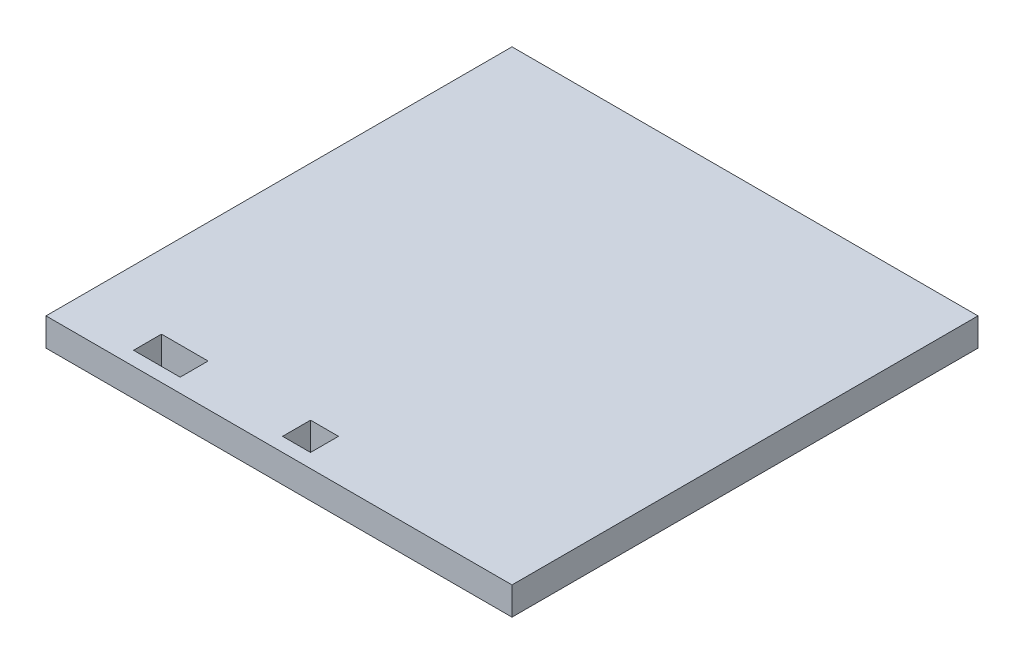
ISO-10303-21;
HEADER;
FILE_DESCRIPTION(('STEP AP214'),'2;1');
FILE_NAME('part.step','',(''),(''),'','','');
FILE_SCHEMA(('AUTOMOTIVE_DESIGN { 1 0 10303 214 1 1 1 1 }'));
ENDSEC;
DATA;
#1=APPLICATION_CONTEXT('core data for automotive mechanical design processes');
#2=APPLICATION_PROTOCOL_DEFINITION('international standard','automotive_design',2000,#1);
#3=PRODUCT_CONTEXT('',#1,'mechanical');
#4=PRODUCT('Part','Part','',(#3));
#5=PRODUCT_RELATED_PRODUCT_CATEGORY('part','',(#4));
#6=PRODUCT_DEFINITION_FORMATION('','',#4);
#7=PRODUCT_DEFINITION_CONTEXT('part definition',#1,'design');
#8=PRODUCT_DEFINITION('design','',#6,#7);
#9=PRODUCT_DEFINITION_SHAPE('','',#8);
#10=(LENGTH_UNIT() NAMED_UNIT(*) SI_UNIT(.MILLI.,.METRE.));
#11=(NAMED_UNIT(*) PLANE_ANGLE_UNIT() SI_UNIT($,.RADIAN.));
#12=(NAMED_UNIT(*) SI_UNIT($,.STERADIAN.) SOLID_ANGLE_UNIT());
#13=UNCERTAINTY_MEASURE_WITH_UNIT(LENGTH_MEASURE(1.E-05),#10,'distance_accuracy_value','');
#14=(GEOMETRIC_REPRESENTATION_CONTEXT(3) GLOBAL_UNCERTAINTY_ASSIGNED_CONTEXT((#13)) GLOBAL_UNIT_ASSIGNED_CONTEXT((#10,
#11,#12)) REPRESENTATION_CONTEXT('',''));
#15=CARTESIAN_POINT('',(0.,0.,0.));
#16=DIRECTION('',(0.,0.,1.));
#17=DIRECTION('',(1.,0.,0.));
#18=AXIS2_PLACEMENT_3D('',#15,#16,#17);
#19=CARTESIAN_POINT('',(50.,6.,-50.));
#20=DIRECTION('',(-1.,0.,0.));
#21=DIRECTION('',(0.,0.,1.));
#22=AXIS2_PLACEMENT_3D('',#19,#20,#21);
#23=PLANE('',#22);
#24=DIRECTION('',(0.,0.,-1.));
#25=VECTOR('',#24,1.);
#26=CARTESIAN_POINT('',(50.,0.,-50.));
#27=LINE('',#26,#25);
#28=CARTESIAN_POINT('',(50.,0.,50.));
#29=VERTEX_POINT('',#28);
#30=CARTESIAN_POINT('',(50.,0.,-50.));
#31=VERTEX_POINT('',#30);
#32=EDGE_CURVE('E185',#29,#31,#27,.T.);
#33=ORIENTED_EDGE('',*,*,#32,.T.);
#34=DIRECTION('',(0.,-1.,0.));
#35=VECTOR('',#34,1.);
#36=CARTESIAN_POINT('',(50.,6.,-50.));
#37=LINE('',#36,#35);
#38=CARTESIAN_POINT('',(50.,6.,-50.));
#39=VERTEX_POINT('',#38);
#40=EDGE_CURVE('E11',#39,#31,#37,.T.);
#41=ORIENTED_EDGE('',*,*,#40,.F.);
#42=DIRECTION('',(0.,0.,-1.));
#43=VECTOR('',#42,1.);
#44=CARTESIAN_POINT('',(50.,6.,-50.));
#45=LINE('',#44,#43);
#46=CARTESIAN_POINT('',(50.,6.,50.));
#47=VERTEX_POINT('',#46);
#48=EDGE_CURVE('E192',#47,#39,#45,.T.);
#49=ORIENTED_EDGE('',*,*,#48,.F.);
#50=DIRECTION('',(0.,-1.,0.));
#51=VECTOR('',#50,1.);
#52=CARTESIAN_POINT('',(50.,6.,50.));
#53=LINE('',#52,#51);
#54=EDGE_CURVE('E202',#47,#29,#53,.T.);
#55=ORIENTED_EDGE('',*,*,#54,.T.);
#56=EDGE_LOOP('',(#33,#41,#49,#55));
#57=FACE_BOUND('',#56,.T.);
#58=ADVANCED_FACE('F35',(#57),#23,.F.);
#59=CARTESIAN_POINT('',(-50.,6.,-50.));
#60=DIRECTION('',(0.,0.,1.));
#61=DIRECTION('',(1.,0.,0.));
#62=AXIS2_PLACEMENT_3D('',#59,#60,#61);
#63=PLANE('',#62);
#64=DIRECTION('',(-1.,0.,0.));
#65=VECTOR('',#64,1.);
#66=CARTESIAN_POINT('',(-50.,0.,-50.));
#67=LINE('',#66,#65);
#68=CARTESIAN_POINT('',(-50.,0.,-50.));
#69=VERTEX_POINT('',#68);
#70=EDGE_CURVE('E205',#31,#69,#67,.T.);
#71=ORIENTED_EDGE('',*,*,#70,.T.);
#72=DIRECTION('',(0.,-1.,0.));
#73=VECTOR('',#72,1.);
#74=CARTESIAN_POINT('',(-50.,6.,-50.));
#75=LINE('',#74,#73);
#76=CARTESIAN_POINT('',(-50.,6.,-50.));
#77=VERTEX_POINT('',#76);
#78=EDGE_CURVE('E42',#77,#69,#75,.T.);
#79=ORIENTED_EDGE('',*,*,#78,.F.);
#80=DIRECTION('',(-1.,0.,0.));
#81=VECTOR('',#80,1.);
#82=CARTESIAN_POINT('',(-50.,6.,-50.));
#83=LINE('',#82,#81);
#84=EDGE_CURVE('E195',#39,#77,#83,.T.);
#85=ORIENTED_EDGE('',*,*,#84,.F.);
#86=ORIENTED_EDGE('',*,*,#40,.T.);
#87=EDGE_LOOP('',(#71,#79,#85,#86));
#88=FACE_BOUND('',#87,.T.);
#89=ADVANCED_FACE('F234',(#88),#63,.F.);
#90=CARTESIAN_POINT('',(-50.,6.,-50.));
#91=DIRECTION('',(1.,0.,0.));
#92=DIRECTION('',(0.,0.,-1.));
#93=AXIS2_PLACEMENT_3D('',#90,#91,#92);
#94=PLANE('',#93);
#95=DIRECTION('',(0.,0.,1.));
#96=VECTOR('',#95,1.);
#97=CARTESIAN_POINT('',(-50.,0.,-50.));
#98=LINE('',#97,#96);
#99=CARTESIAN_POINT('',(-50.,0.,50.));
#100=VERTEX_POINT('',#99);
#101=EDGE_CURVE('E207',#69,#100,#98,.T.);
#102=ORIENTED_EDGE('',*,*,#101,.T.);
#103=DIRECTION('',(0.,-1.,0.));
#104=VECTOR('',#103,1.);
#105=CARTESIAN_POINT('',(-50.,6.,50.));
#106=LINE('',#105,#104);
#107=CARTESIAN_POINT('',(-50.,6.,50.));
#108=VERTEX_POINT('',#107);
#109=EDGE_CURVE('E212',#108,#100,#106,.T.);
#110=ORIENTED_EDGE('',*,*,#109,.F.);
#111=DIRECTION('',(0.,0.,1.));
#112=VECTOR('',#111,1.);
#113=CARTESIAN_POINT('',(-50.,6.,-50.));
#114=LINE('',#113,#112);
#115=EDGE_CURVE('E198',#77,#108,#114,.T.);
#116=ORIENTED_EDGE('',*,*,#115,.F.);
#117=ORIENTED_EDGE('',*,*,#78,.T.);
#118=EDGE_LOOP('',(#102,#110,#116,#117));
#119=FACE_BOUND('',#118,.T.);
#120=ADVANCED_FACE('F219',(#119),#94,.F.);
#121=CARTESIAN_POINT('',(-50.,6.,50.));
#122=DIRECTION('',(0.,0.,-1.));
#123=DIRECTION('',(-1.,0.,0.));
#124=AXIS2_PLACEMENT_3D('',#121,#122,#123);
#125=PLANE('',#124);
#126=DIRECTION('',(1.,0.,0.));
#127=VECTOR('',#126,1.);
#128=CARTESIAN_POINT('',(-50.,0.,50.));
#129=LINE('',#128,#127);
#130=EDGE_CURVE('E196',#100,#29,#129,.T.);
#131=ORIENTED_EDGE('',*,*,#130,.T.);
#132=ORIENTED_EDGE('',*,*,#54,.F.);
#133=DIRECTION('',(1.,0.,0.));
#134=VECTOR('',#133,1.);
#135=CARTESIAN_POINT('',(-50.,6.,50.));
#136=LINE('',#135,#134);
#137=EDGE_CURVE('E200',#108,#47,#136,.T.);
#138=ORIENTED_EDGE('',*,*,#137,.F.);
#139=ORIENTED_EDGE('',*,*,#109,.T.);
#140=EDGE_LOOP('',(#131,#132,#138,#139));
#141=FACE_BOUND('',#140,.T.);
#142=ADVANCED_FACE('F228',(#141),#125,.F.);
#143=CARTESIAN_POINT('',(0.,6.,0.));
#144=DIRECTION('',(0.,1.,0.));
#145=DIRECTION('',(0.,0.,1.));
#146=AXIS2_PLACEMENT_3D('',#143,#144,#145);
#147=PLANE('',#146);
#148=DIRECTION('',(0.,0.,1.));
#149=VECTOR('',#148,1.);
#150=CARTESIAN_POINT('',(-34.2132137689734,6.,47.));
#151=LINE('',#150,#149);
#152=CARTESIAN_POINT('',(-34.2132137689734,6.,41.));
#153=VERTEX_POINT('',#152);
#154=CARTESIAN_POINT('',(-34.2132137689734,6.,47.));
#155=VERTEX_POINT('',#154);
#156=EDGE_CURVE('E49',#153,#155,#151,.T.);
#157=ORIENTED_EDGE('',*,*,#156,.F.);
#158=DIRECTION('',(-1.,0.,0.));
#159=VECTOR('',#158,1.);
#160=CARTESIAN_POINT('',(-24.2132137689734,6.,41.));
#161=LINE('',#160,#159);
#162=CARTESIAN_POINT('',(-24.2132137689734,6.,41.));
#163=VERTEX_POINT('',#162);
#164=EDGE_CURVE('E141',#163,#153,#161,.T.);
#165=ORIENTED_EDGE('',*,*,#164,.F.);
#166=DIRECTION('',(0.,0.,-1.));
#167=VECTOR('',#166,1.);
#168=CARTESIAN_POINT('',(-24.2132137689734,6.,47.));
#169=LINE('',#168,#167);
#170=CARTESIAN_POINT('',(-24.2132137689734,6.,47.));
#171=VERTEX_POINT('',#170);
#172=EDGE_CURVE('E125',#171,#163,#169,.T.);
#173=ORIENTED_EDGE('',*,*,#172,.F.);
#174=DIRECTION('',(1.,0.,0.));
#175=VECTOR('',#174,1.);
#176=CARTESIAN_POINT('',(-24.2132137689734,6.,47.));
#177=LINE('',#176,#175);
#178=EDGE_CURVE('E134',#155,#171,#177,.T.);
#179=ORIENTED_EDGE('',*,*,#178,.F.);
#180=EDGE_LOOP('',(#157,#165,#173,#179));
#181=FACE_BOUND('',#180,.T.);
#182=DIRECTION('',(0.,0.,-1.));
#183=VECTOR('',#182,1.);
#184=CARTESIAN_POINT('',(3.76777860779307,6.,41.));
#185=LINE('',#184,#183);
#186=CARTESIAN_POINT('',(3.76777860779307,6.,47.));
#187=VERTEX_POINT('',#186);
#188=CARTESIAN_POINT('',(3.76777860779307,6.,41.));
#189=VERTEX_POINT('',#188);
#190=EDGE_CURVE('E157',#187,#189,#185,.T.);
#191=ORIENTED_EDGE('',*,*,#190,.F.);
#192=DIRECTION('',(1.,0.,0.));
#193=VECTOR('',#192,1.);
#194=CARTESIAN_POINT('',(-2.23222139220693,6.,47.));
#195=LINE('',#194,#193);
#196=CARTESIAN_POINT('',(-2.23222139220693,6.,47.));
#197=VERTEX_POINT('',#196);
#198=EDGE_CURVE('E167',#197,#187,#195,.T.);
#199=ORIENTED_EDGE('',*,*,#198,.F.);
#200=DIRECTION('',(0.,0.,1.));
#201=VECTOR('',#200,1.);
#202=CARTESIAN_POINT('',(-2.23222139220693,6.,41.));
#203=LINE('',#202,#201);
#204=CARTESIAN_POINT('',(-2.23222139220693,6.,41.));
#205=VERTEX_POINT('',#204);
#206=EDGE_CURVE('E164',#205,#197,#203,.T.);
#207=ORIENTED_EDGE('',*,*,#206,.F.);
#208=DIRECTION('',(-1.,0.,0.));
#209=VECTOR('',#208,1.);
#210=CARTESIAN_POINT('',(-2.23222139220693,6.,41.));
#211=LINE('',#210,#209);
#212=EDGE_CURVE('E161',#189,#205,#211,.T.);
#213=ORIENTED_EDGE('',*,*,#212,.F.);
#214=EDGE_LOOP('',(#191,#199,#207,#213));
#215=FACE_BOUND('',#214,.T.);
#216=ORIENTED_EDGE('',*,*,#48,.T.);
#217=ORIENTED_EDGE('',*,*,#84,.T.);
#218=ORIENTED_EDGE('',*,*,#115,.T.);
#219=ORIENTED_EDGE('',*,*,#137,.T.);
#220=EDGE_LOOP('',(#216,#217,#218,#219));
#221=FACE_BOUND('',#220,.T.);
#222=ADVANCED_FACE('F138',(#181,#215,#221),#147,.T.);
#223=CARTESIAN_POINT('',(0.,0.,0.));
#224=DIRECTION('',(0.,1.,0.));
#225=DIRECTION('',(0.,0.,1.));
#226=AXIS2_PLACEMENT_3D('',#223,#224,#225);
#227=PLANE('',#226);
#228=DIRECTION('',(-1.,0.,0.));
#229=VECTOR('',#228,1.);
#230=CARTESIAN_POINT('',(-24.2132137689734,0.,41.));
#231=LINE('',#230,#229);
#232=CARTESIAN_POINT('',(-24.2132137689734,0.,41.));
#233=VERTEX_POINT('',#232);
#234=CARTESIAN_POINT('',(-34.2132137689734,0.,41.));
#235=VERTEX_POINT('',#234);
#236=EDGE_CURVE('E152',#233,#235,#231,.T.);
#237=ORIENTED_EDGE('',*,*,#236,.T.);
#238=DIRECTION('',(0.,0.,1.));
#239=VECTOR('',#238,1.);
#240=CARTESIAN_POINT('',(-34.2132137689734,0.,47.));
#241=LINE('',#240,#239);
#242=CARTESIAN_POINT('',(-34.2132137689734,0.,47.));
#243=VERTEX_POINT('',#242);
#244=EDGE_CURVE('E143',#235,#243,#241,.T.);
#245=ORIENTED_EDGE('',*,*,#244,.T.);
#246=DIRECTION('',(1.,0.,0.));
#247=VECTOR('',#246,1.);
#248=CARTESIAN_POINT('',(-24.2132137689734,0.,47.));
#249=LINE('',#248,#247);
#250=CARTESIAN_POINT('',(-24.2132137689734,0.,47.));
#251=VERTEX_POINT('',#250);
#252=EDGE_CURVE('E149',#243,#251,#249,.T.);
#253=ORIENTED_EDGE('',*,*,#252,.T.);
#254=DIRECTION('',(0.,0.,-1.));
#255=VECTOR('',#254,1.);
#256=CARTESIAN_POINT('',(-24.2132137689734,0.,47.));
#257=LINE('',#256,#255);
#258=EDGE_CURVE('E57',#251,#233,#257,.T.);
#259=ORIENTED_EDGE('',*,*,#258,.T.);
#260=EDGE_LOOP('',(#237,#245,#253,#259));
#261=FACE_BOUND('',#260,.T.);
#262=DIRECTION('',(1.,0.,0.));
#263=VECTOR('',#262,1.);
#264=CARTESIAN_POINT('',(-2.23222139220693,0.,47.));
#265=LINE('',#264,#263);
#266=CARTESIAN_POINT('',(-2.23222139220693,0.,47.));
#267=VERTEX_POINT('',#266);
#268=CARTESIAN_POINT('',(3.76777860779307,0.,47.));
#269=VERTEX_POINT('',#268);
#270=EDGE_CURVE('E179',#267,#269,#265,.T.);
#271=ORIENTED_EDGE('',*,*,#270,.T.);
#272=DIRECTION('',(0.,0.,-1.));
#273=VECTOR('',#272,1.);
#274=CARTESIAN_POINT('',(3.76777860779307,0.,41.));
#275=LINE('',#274,#273);
#276=CARTESIAN_POINT('',(3.76777860779307,0.,41.));
#277=VERTEX_POINT('',#276);
#278=EDGE_CURVE('E170',#269,#277,#275,.T.);
#279=ORIENTED_EDGE('',*,*,#278,.T.);
#280=DIRECTION('',(-1.,0.,0.));
#281=VECTOR('',#280,1.);
#282=CARTESIAN_POINT('',(-2.23222139220693,0.,41.));
#283=LINE('',#282,#281);
#284=CARTESIAN_POINT('',(-2.23222139220693,0.,41.));
#285=VERTEX_POINT('',#284);
#286=EDGE_CURVE('E173',#277,#285,#283,.T.);
#287=ORIENTED_EDGE('',*,*,#286,.T.);
#288=DIRECTION('',(0.,0.,1.));
#289=VECTOR('',#288,1.);
#290=CARTESIAN_POINT('',(-2.23222139220693,0.,41.));
#291=LINE('',#290,#289);
#292=EDGE_CURVE('E176',#285,#267,#291,.T.);
#293=ORIENTED_EDGE('',*,*,#292,.T.);
#294=EDGE_LOOP('',(#271,#279,#287,#293));
#295=FACE_BOUND('',#294,.T.);
#296=ORIENTED_EDGE('',*,*,#32,.F.);
#297=ORIENTED_EDGE('',*,*,#130,.F.);
#298=ORIENTED_EDGE('',*,*,#101,.F.);
#299=ORIENTED_EDGE('',*,*,#70,.F.);
#300=EDGE_LOOP('',(#296,#297,#298,#299));
#301=FACE_BOUND('',#300,.T.);
#302=ADVANCED_FACE('F225',(#261,#295,#301),#227,.F.);
#303=CARTESIAN_POINT('',(3.76777860779307,0.,41.));
#304=DIRECTION('',(1.,0.,0.));
#305=DIRECTION('',(0.,0.,-1.));
#306=AXIS2_PLACEMENT_3D('',#303,#304,#305);
#307=PLANE('',#306);
#308=DIRECTION('',(0.,1.,0.));
#309=VECTOR('',#308,1.);
#310=CARTESIAN_POINT('',(3.76777860779307,0.,41.));
#311=LINE('',#310,#309);
#312=EDGE_CURVE('E182',#277,#189,#311,.T.);
#313=ORIENTED_EDGE('',*,*,#312,.F.);
#314=ORIENTED_EDGE('',*,*,#278,.F.);
#315=DIRECTION('',(0.,1.,0.));
#316=VECTOR('',#315,1.);
#317=CARTESIAN_POINT('',(3.76777860779307,0.,47.));
#318=LINE('',#317,#316);
#319=EDGE_CURVE('E183',#269,#187,#318,.T.);
#320=ORIENTED_EDGE('',*,*,#319,.T.);
#321=ORIENTED_EDGE('',*,*,#190,.T.);
#322=EDGE_LOOP('',(#313,#314,#320,#321));
#323=FACE_BOUND('',#322,.T.);
#324=ADVANCED_FACE('F246',(#323),#307,.F.);
#325=CARTESIAN_POINT('',(-2.23222139220693,0.,47.));
#326=DIRECTION('',(0.,0.,1.));
#327=DIRECTION('',(1.,0.,0.));
#328=AXIS2_PLACEMENT_3D('',#325,#326,#327);
#329=PLANE('',#328);
#330=ORIENTED_EDGE('',*,*,#319,.F.);
#331=ORIENTED_EDGE('',*,*,#270,.F.);
#332=DIRECTION('',(0.,1.,0.));
#333=VECTOR('',#332,1.);
#334=CARTESIAN_POINT('',(-2.23222139220693,0.,47.));
#335=LINE('',#334,#333);
#336=EDGE_CURVE('E186',#267,#197,#335,.T.);
#337=ORIENTED_EDGE('',*,*,#336,.T.);
#338=ORIENTED_EDGE('',*,*,#198,.T.);
#339=EDGE_LOOP('',(#330,#331,#337,#338));
#340=FACE_BOUND('',#339,.T.);
#341=ADVANCED_FACE('F252',(#340),#329,.F.);
#342=CARTESIAN_POINT('',(-2.23222139220693,0.,41.));
#343=DIRECTION('',(-1.,0.,0.));
#344=DIRECTION('',(0.,0.,1.));
#345=AXIS2_PLACEMENT_3D('',#342,#343,#344);
#346=PLANE('',#345);
#347=ORIENTED_EDGE('',*,*,#336,.F.);
#348=ORIENTED_EDGE('',*,*,#292,.F.);
#349=DIRECTION('',(0.,1.,0.));
#350=VECTOR('',#349,1.);
#351=CARTESIAN_POINT('',(-2.23222139220693,0.,41.));
#352=LINE('',#351,#350);
#353=EDGE_CURVE('E188',#285,#205,#352,.T.);
#354=ORIENTED_EDGE('',*,*,#353,.T.);
#355=ORIENTED_EDGE('',*,*,#206,.T.);
#356=EDGE_LOOP('',(#347,#348,#354,#355));
#357=FACE_BOUND('',#356,.T.);
#358=ADVANCED_FACE('F258',(#357),#346,.F.);
#359=CARTESIAN_POINT('',(-2.23222139220693,0.,41.));
#360=DIRECTION('',(0.,0.,-1.));
#361=DIRECTION('',(-1.,0.,0.));
#362=AXIS2_PLACEMENT_3D('',#359,#360,#361);
#363=PLANE('',#362);
#364=ORIENTED_EDGE('',*,*,#353,.F.);
#365=ORIENTED_EDGE('',*,*,#286,.F.);
#366=ORIENTED_EDGE('',*,*,#312,.T.);
#367=ORIENTED_EDGE('',*,*,#212,.T.);
#368=EDGE_LOOP('',(#364,#365,#366,#367));
#369=FACE_BOUND('',#368,.T.);
#370=ADVANCED_FACE('F254',(#369),#363,.F.);
#371=CARTESIAN_POINT('',(-34.2132137689734,0.,47.));
#372=DIRECTION('',(-1.,0.,0.));
#373=DIRECTION('',(0.,0.,1.));
#374=AXIS2_PLACEMENT_3D('',#371,#372,#373);
#375=PLANE('',#374);
#376=DIRECTION('',(0.,1.,0.));
#377=VECTOR('',#376,1.);
#378=CARTESIAN_POINT('',(-34.2132137689734,0.,47.));
#379=LINE('',#378,#377);
#380=EDGE_CURVE('E131',#243,#155,#379,.T.);
#381=ORIENTED_EDGE('',*,*,#380,.F.);
#382=ORIENTED_EDGE('',*,*,#244,.F.);
#383=DIRECTION('',(0.,1.,0.));
#384=VECTOR('',#383,1.);
#385=CARTESIAN_POINT('',(-34.2132137689734,0.,41.));
#386=LINE('',#385,#384);
#387=EDGE_CURVE('E155',#235,#153,#386,.T.);
#388=ORIENTED_EDGE('',*,*,#387,.T.);
#389=ORIENTED_EDGE('',*,*,#156,.T.);
#390=EDGE_LOOP('',(#381,#382,#388,#389));
#391=FACE_BOUND('',#390,.T.);
#392=ADVANCED_FACE('F257',(#391),#375,.F.);
#393=CARTESIAN_POINT('',(-24.2132137689734,0.,41.));
#394=DIRECTION('',(0.,0.,-1.));
#395=DIRECTION('',(-1.,0.,0.));
#396=AXIS2_PLACEMENT_3D('',#393,#394,#395);
#397=PLANE('',#396);
#398=ORIENTED_EDGE('',*,*,#387,.F.);
#399=ORIENTED_EDGE('',*,*,#236,.F.);
#400=DIRECTION('',(0.,1.,0.));
#401=VECTOR('',#400,1.);
#402=CARTESIAN_POINT('',(-24.2132137689734,0.,41.));
#403=LINE('',#402,#401);
#404=EDGE_CURVE('E130',#233,#163,#403,.T.);
#405=ORIENTED_EDGE('',*,*,#404,.T.);
#406=ORIENTED_EDGE('',*,*,#164,.T.);
#407=EDGE_LOOP('',(#398,#399,#405,#406));
#408=FACE_BOUND('',#407,.T.);
#409=ADVANCED_FACE('F268',(#408),#397,.F.);
#410=CARTESIAN_POINT('',(-24.2132137689734,0.,47.));
#411=DIRECTION('',(1.,0.,0.));
#412=DIRECTION('',(0.,0.,-1.));
#413=AXIS2_PLACEMENT_3D('',#410,#411,#412);
#414=PLANE('',#413);
#415=ORIENTED_EDGE('',*,*,#404,.F.);
#416=ORIENTED_EDGE('',*,*,#258,.F.);
#417=DIRECTION('',(0.,1.,0.));
#418=VECTOR('',#417,1.);
#419=CARTESIAN_POINT('',(-24.2132137689734,0.,47.));
#420=LINE('',#419,#418);
#421=EDGE_CURVE('E121',#251,#171,#420,.T.);
#422=ORIENTED_EDGE('',*,*,#421,.T.);
#423=ORIENTED_EDGE('',*,*,#172,.T.);
#424=EDGE_LOOP('',(#415,#416,#422,#423));
#425=FACE_BOUND('',#424,.T.);
#426=ADVANCED_FACE('F123',(#425),#414,.F.);
#427=CARTESIAN_POINT('',(-24.2132137689734,0.,47.));
#428=DIRECTION('',(0.,0.,1.));
#429=DIRECTION('',(1.,0.,0.));
#430=AXIS2_PLACEMENT_3D('',#427,#428,#429);
#431=PLANE('',#430);
#432=ORIENTED_EDGE('',*,*,#421,.F.);
#433=ORIENTED_EDGE('',*,*,#252,.F.);
#434=ORIENTED_EDGE('',*,*,#380,.T.);
#435=ORIENTED_EDGE('',*,*,#178,.T.);
#436=EDGE_LOOP('',(#432,#433,#434,#435));
#437=FACE_BOUND('',#436,.T.);
#438=ADVANCED_FACE('F135',(#437),#431,.F.);
#439=CLOSED_SHELL('',(#58,#89,#120,#142,#222,#302,#324,#341,#358,#370,#392,#409,#426,#438));
#440=MANIFOLD_SOLID_BREP('B2',#439);
#441=ADVANCED_BREP_SHAPE_REPRESENTATION('',(#18,#440),#14);
#442=SHAPE_DEFINITION_REPRESENTATION(#9,#441);
ENDSEC;
END-ISO-10303-21;
